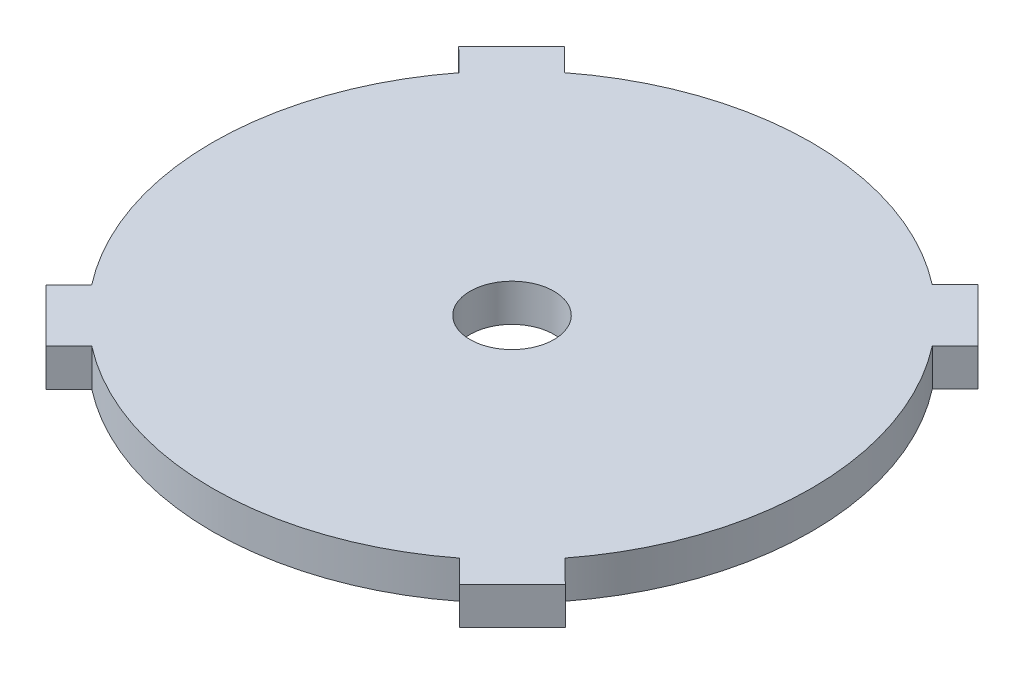
ISO-10303-21;
HEADER;
FILE_DESCRIPTION(('STEP AP214'),'2;1');
FILE_NAME('part.step','',(''),(''),'','','');
FILE_SCHEMA(('AUTOMOTIVE_DESIGN { 1 0 10303 214 1 1 1 1 }'));
ENDSEC;
DATA;
#1=APPLICATION_CONTEXT('core data for automotive mechanical design processes');
#2=APPLICATION_PROTOCOL_DEFINITION('international standard','automotive_design',2000,#1);
#3=PRODUCT_CONTEXT('',#1,'mechanical');
#4=PRODUCT('Part','Part','',(#3));
#5=PRODUCT_RELATED_PRODUCT_CATEGORY('part','',(#4));
#6=PRODUCT_DEFINITION_FORMATION('','',#4);
#7=PRODUCT_DEFINITION_CONTEXT('part definition',#1,'design');
#8=PRODUCT_DEFINITION('design','',#6,#7);
#9=PRODUCT_DEFINITION_SHAPE('','',#8);
#10=(LENGTH_UNIT() NAMED_UNIT(*) SI_UNIT(.MILLI.,.METRE.));
#11=(NAMED_UNIT(*) PLANE_ANGLE_UNIT() SI_UNIT($,.RADIAN.));
#12=(NAMED_UNIT(*) SI_UNIT($,.STERADIAN.) SOLID_ANGLE_UNIT());
#13=UNCERTAINTY_MEASURE_WITH_UNIT(LENGTH_MEASURE(1.E-05),#10,'distance_accuracy_value','');
#14=(GEOMETRIC_REPRESENTATION_CONTEXT(3) GLOBAL_UNCERTAINTY_ASSIGNED_CONTEXT((#13)) GLOBAL_UNIT_ASSIGNED_CONTEXT((#10,
#11,#12)) REPRESENTATION_CONTEXT('',''));
#15=CARTESIAN_POINT('',(0.,0.,0.));
#16=DIRECTION('',(0.,0.,1.));
#17=DIRECTION('',(1.,0.,0.));
#18=AXIS2_PLACEMENT_3D('',#15,#16,#17);
#19=CARTESIAN_POINT('',(0.,3.175,0.));
#20=DIRECTION('',(0.,1.,0.));
#21=DIRECTION('',(0.,0.,1.));
#22=AXIS2_PLACEMENT_3D('',#19,#20,#21);
#23=PLANE('',#22);
#24=CARTESIAN_POINT('',(0.,3.175,0.));
#25=DIRECTION('',(0.,1.,0.));
#26=DIRECTION('',(0.,0.,1.));
#27=AXIS2_PLACEMENT_3D('',#24,#25,#26);
#28=CIRCLE('',#27,25.4);
#29=CARTESIAN_POINT('',(15.5615434417537,3.175,-20.074819194962));
#30=VERTEX_POINT('',#29);
#31=CARTESIAN_POINT('',(-15.5876085360687,3.175,-20.0545870096165));
#32=VERTEX_POINT('',#31);
#33=EDGE_CURVE('E210',#30,#32,#28,.T.);
#34=ORIENTED_EDGE('',*,*,#33,.T.);
#35=DIRECTION('',(-0.70756591619888,0.,-0.706647347857218));
#36=VECTOR('',#35,1.);
#37=CARTESIAN_POINT('',(-15.5876085360687,3.175,-20.0545870096165));
#38=LINE('',#37,#36);
#39=CARTESIAN_POINT('',(-17.52578636915,3.175,-21.9902486830621));
#40=VERTEX_POINT('',#39);
#41=EDGE_CURVE('E118',#32,#40,#38,.T.);
#42=ORIENTED_EDGE('',*,*,#41,.T.);
#43=DIRECTION('',(-0.706647347857217,0.,0.70756591619888));
#44=VECTOR('',#43,1.);
#45=CARTESIAN_POINT('',(-22.0129970280434,3.175,-17.4972051151992));
#46=LINE('',#45,#44);
#47=CARTESIAN_POINT('',(-22.0129970280434,3.175,-17.4972051151992));
#48=VERTEX_POINT('',#47);
#49=EDGE_CURVE('E249',#40,#48,#46,.T.);
#50=ORIENTED_EDGE('',*,*,#49,.T.);
#51=DIRECTION('',(0.707565916198881,0.,0.706647347857217));
#52=VECTOR('',#51,1.);
#53=CARTESIAN_POINT('',(-20.074819194962,3.175,-15.5615434417536));
#54=LINE('',#53,#52);
#55=CARTESIAN_POINT('',(-20.074819194962,3.175,-15.5615434417536));
#56=VERTEX_POINT('',#55);
#57=EDGE_CURVE('E268',#48,#56,#54,.T.);
#58=ORIENTED_EDGE('',*,*,#57,.T.);
#59=CARTESIAN_POINT('',(0.,3.175,0.));
#60=DIRECTION('',(0.,1.,0.));
#61=DIRECTION('',(0.,0.,1.));
#62=AXIS2_PLACEMENT_3D('',#59,#60,#61);
#63=CIRCLE('',#62,25.4);
#64=CARTESIAN_POINT('',(-20.0545870096166,3.175,15.5876085360686));
#65=VERTEX_POINT('',#64);
#66=EDGE_CURVE('E265',#56,#65,#63,.T.);
#67=ORIENTED_EDGE('',*,*,#66,.T.);
#68=DIRECTION('',(-0.70664734785722,0.,0.707565916198878));
#69=VECTOR('',#68,1.);
#70=CARTESIAN_POINT('',(-21.9902486830621,3.175,17.5257863691499));
#71=LINE('',#70,#69);
#72=CARTESIAN_POINT('',(-21.9902486830621,3.175,17.5257863691499));
#73=VERTEX_POINT('',#72);
#74=EDGE_CURVE('E267',#65,#73,#71,.T.);
#75=ORIENTED_EDGE('',*,*,#74,.T.);
#76=DIRECTION('',(0.707565916198878,0.,0.70664734785722));
#77=VECTOR('',#76,1.);
#78=CARTESIAN_POINT('',(-21.9902486830621,3.175,17.5257863691499));
#79=LINE('',#78,#77);
#80=CARTESIAN_POINT('',(-17.4972051151993,3.175,22.0129970280433));
#81=VERTEX_POINT('',#80);
#82=EDGE_CURVE('E270',#73,#81,#79,.T.);
#83=ORIENTED_EDGE('',*,*,#82,.T.);
#84=DIRECTION('',(0.706647347857219,0.,-0.707565916198879));
#85=VECTOR('',#84,1.);
#86=CARTESIAN_POINT('',(-17.4972051151993,3.175,22.0129970280433));
#87=LINE('',#86,#85);
#88=CARTESIAN_POINT('',(-15.5615434417537,3.175,20.074819194962));
#89=VERTEX_POINT('',#88);
#90=EDGE_CURVE('E276',#81,#89,#87,.T.);
#91=ORIENTED_EDGE('',*,*,#90,.T.);
#92=CARTESIAN_POINT('',(0.,3.175,0.));
#93=DIRECTION('',(0.,1.,0.));
#94=DIRECTION('',(0.,0.,1.));
#95=AXIS2_PLACEMENT_3D('',#92,#93,#94);
#96=CIRCLE('',#95,25.4);
#97=CARTESIAN_POINT('',(15.5876085360687,3.175,20.0545870096165));
#98=VERTEX_POINT('',#97);
#99=EDGE_CURVE('E278',#89,#98,#96,.T.);
#100=ORIENTED_EDGE('',*,*,#99,.T.);
#101=DIRECTION('',(0.707565916198882,0.,0.706647347857216));
#102=VECTOR('',#101,1.);
#103=CARTESIAN_POINT('',(17.52578636915,3.175,21.990248683062));
#104=LINE('',#103,#102);
#105=CARTESIAN_POINT('',(17.52578636915,3.175,21.990248683062));
#106=VERTEX_POINT('',#105);
#107=EDGE_CURVE('E280',#98,#106,#104,.T.);
#108=ORIENTED_EDGE('',*,*,#107,.T.);
#109=DIRECTION('',(0.706647347857217,0.,-0.70756591619888));
#110=VECTOR('',#109,1.);
#111=CARTESIAN_POINT('',(17.52578636915,3.175,21.990248683062));
#112=LINE('',#111,#110);
#113=CARTESIAN_POINT('',(22.0129970280433,3.175,17.4972051151992));
#114=VERTEX_POINT('',#113);
#115=EDGE_CURVE('E282',#106,#114,#112,.T.);
#116=ORIENTED_EDGE('',*,*,#115,.T.);
#117=DIRECTION('',(-0.707565916198865,0.,-0.706647347857232));
#118=VECTOR('',#117,1.);
#119=CARTESIAN_POINT('',(22.0129970280433,3.175,17.4972051151992));
#120=LINE('',#119,#118);
#121=CARTESIAN_POINT('',(20.074819194962,3.175,15.5615434417536));
#122=VERTEX_POINT('',#121);
#123=EDGE_CURVE('E284',#114,#122,#120,.T.);
#124=ORIENTED_EDGE('',*,*,#123,.T.);
#125=CARTESIAN_POINT('',(0.,3.175,0.));
#126=DIRECTION('',(0.,1.,0.));
#127=DIRECTION('',(0.,0.,1.));
#128=AXIS2_PLACEMENT_3D('',#125,#126,#127);
#129=CIRCLE('',#128,25.4);
#130=CARTESIAN_POINT('',(20.0545870096165,3.175,-15.5876085360686));
#131=VERTEX_POINT('',#130);
#132=EDGE_CURVE('E161',#122,#131,#129,.T.);
#133=ORIENTED_EDGE('',*,*,#132,.T.);
#134=DIRECTION('',(0.70664734785722,0.,-0.707565916198878));
#135=VECTOR('',#134,1.);
#136=CARTESIAN_POINT('',(20.0545870096165,3.175,-15.5876085360686));
#137=LINE('',#136,#135);
#138=CARTESIAN_POINT('',(21.9902486830621,3.175,-17.52578636915));
#139=VERTEX_POINT('',#138);
#140=EDGE_CURVE('E155',#131,#139,#137,.T.);
#141=ORIENTED_EDGE('',*,*,#140,.T.);
#142=DIRECTION('',(-0.707565916198878,0.,-0.706647347857219));
#143=VECTOR('',#142,1.);
#144=CARTESIAN_POINT('',(17.4972051151992,3.175,-22.0129970280433));
#145=LINE('',#144,#143);
#146=CARTESIAN_POINT('',(17.4972051151992,3.175,-22.0129970280433));
#147=VERTEX_POINT('',#146);
#148=EDGE_CURVE('E159',#139,#147,#145,.T.);
#149=ORIENTED_EDGE('',*,*,#148,.T.);
#150=DIRECTION('',(-0.706647347857219,0.,0.707565916198879));
#151=VECTOR('',#150,1.);
#152=CARTESIAN_POINT('',(15.5615434417537,3.175,-20.074819194962));
#153=LINE('',#152,#151);
#154=EDGE_CURVE('E51',#147,#30,#153,.T.);
#155=ORIENTED_EDGE('',*,*,#154,.T.);
#156=EDGE_LOOP('',(#34,#42,#50,#58,#67,#75,#83,#91,#100,#108,#116,#124,#133,#141,#149,#155));
#157=FACE_BOUND('',#156,.T.);
#158=CARTESIAN_POINT('',(0.,3.175,0.));
#159=DIRECTION('',(0.,1.,0.));
#160=DIRECTION('',(0.,0.,1.));
#161=AXIS2_PLACEMENT_3D('',#158,#159,#160);
#162=CIRCLE('',#161,3.556);
#163=CARTESIAN_POINT('',(0.,3.175,3.556));
#164=VERTEX_POINT('',#163);
#165=EDGE_CURVE('E183',#164,#164,#162,.T.);
#166=ORIENTED_EDGE('',*,*,#165,.F.);
#167=EDGE_LOOP('',(#166));
#168=FACE_BOUND('',#167,.T.);
#169=ADVANCED_FACE('F34',(#157,#168),#23,.T.);
#170=CARTESIAN_POINT('',(0.,0.,0.));
#171=DIRECTION('',(0.,1.,0.));
#172=DIRECTION('',(0.,0.,1.));
#173=AXIS2_PLACEMENT_3D('',#170,#171,#172);
#174=PLANE('',#173);
#175=CARTESIAN_POINT('',(0.,0.,0.));
#176=DIRECTION('',(0.,1.,0.));
#177=DIRECTION('',(0.,0.,1.));
#178=AXIS2_PLACEMENT_3D('',#175,#176,#177);
#179=CIRCLE('',#178,25.4);
#180=CARTESIAN_POINT('',(15.5615434417537,0.,-20.074819194962));
#181=VERTEX_POINT('',#180);
#182=CARTESIAN_POINT('',(-15.5876085360687,0.,-20.0545870096165));
#183=VERTEX_POINT('',#182);
#184=EDGE_CURVE('E179',#181,#183,#179,.T.);
#185=ORIENTED_EDGE('',*,*,#184,.F.);
#186=DIRECTION('',(-0.706647347857219,0.,0.707565916198879));
#187=VECTOR('',#186,1.);
#188=CARTESIAN_POINT('',(15.5615434417537,0.,-20.074819194962));
#189=LINE('',#188,#187);
#190=CARTESIAN_POINT('',(17.4972051151992,0.,-22.0129970280433));
#191=VERTEX_POINT('',#190);
#192=EDGE_CURVE('E110',#191,#181,#189,.T.);
#193=ORIENTED_EDGE('',*,*,#192,.F.);
#194=DIRECTION('',(-0.707565916198878,0.,-0.706647347857219));
#195=VECTOR('',#194,1.);
#196=CARTESIAN_POINT('',(17.4972051151992,0.,-22.0129970280433));
#197=LINE('',#196,#195);
#198=CARTESIAN_POINT('',(21.9902486830621,0.,-17.52578636915));
#199=VERTEX_POINT('',#198);
#200=EDGE_CURVE('E104',#199,#191,#197,.T.);
#201=ORIENTED_EDGE('',*,*,#200,.F.);
#202=DIRECTION('',(0.70664734785722,0.,-0.707565916198878));
#203=VECTOR('',#202,1.);
#204=CARTESIAN_POINT('',(20.0545870096165,0.,-15.5876085360686));
#205=LINE('',#204,#203);
#206=CARTESIAN_POINT('',(20.0545870096165,0.,-15.5876085360686));
#207=VERTEX_POINT('',#206);
#208=EDGE_CURVE('E169',#207,#199,#205,.T.);
#209=ORIENTED_EDGE('',*,*,#208,.F.);
#210=CARTESIAN_POINT('',(0.,0.,0.));
#211=DIRECTION('',(0.,1.,0.));
#212=DIRECTION('',(0.,0.,1.));
#213=AXIS2_PLACEMENT_3D('',#210,#211,#212);
#214=CIRCLE('',#213,25.4);
#215=CARTESIAN_POINT('',(20.074819194962,0.,15.5615434417536));
#216=VERTEX_POINT('',#215);
#217=EDGE_CURVE('E205',#216,#207,#214,.T.);
#218=ORIENTED_EDGE('',*,*,#217,.F.);
#219=DIRECTION('',(-0.707565916198865,0.,-0.706647347857232));
#220=VECTOR('',#219,1.);
#221=CARTESIAN_POINT('',(22.0129970280433,0.,17.4972051151992));
#222=LINE('',#221,#220);
#223=CARTESIAN_POINT('',(22.0129970280433,0.,17.4972051151992));
#224=VERTEX_POINT('',#223);
#225=EDGE_CURVE('E203',#224,#216,#222,.T.);
#226=ORIENTED_EDGE('',*,*,#225,.F.);
#227=DIRECTION('',(0.706647347857217,0.,-0.70756591619888));
#228=VECTOR('',#227,1.);
#229=CARTESIAN_POINT('',(17.52578636915,0.,21.990248683062));
#230=LINE('',#229,#228);
#231=CARTESIAN_POINT('',(17.52578636915,0.,21.990248683062));
#232=VERTEX_POINT('',#231);
#233=EDGE_CURVE('E201',#232,#224,#230,.T.);
#234=ORIENTED_EDGE('',*,*,#233,.F.);
#235=DIRECTION('',(0.707565916198882,0.,0.706647347857216));
#236=VECTOR('',#235,1.);
#237=CARTESIAN_POINT('',(17.52578636915,0.,21.990248683062));
#238=LINE('',#237,#236);
#239=CARTESIAN_POINT('',(15.5876085360687,0.,20.0545870096165));
#240=VERTEX_POINT('',#239);
#241=EDGE_CURVE('E199',#240,#232,#238,.T.);
#242=ORIENTED_EDGE('',*,*,#241,.F.);
#243=CARTESIAN_POINT('',(0.,0.,0.));
#244=DIRECTION('',(0.,1.,0.));
#245=DIRECTION('',(0.,0.,1.));
#246=AXIS2_PLACEMENT_3D('',#243,#244,#245);
#247=CIRCLE('',#246,25.4);
#248=CARTESIAN_POINT('',(-15.5615434417537,0.,20.074819194962));
#249=VERTEX_POINT('',#248);
#250=EDGE_CURVE('E197',#249,#240,#247,.T.);
#251=ORIENTED_EDGE('',*,*,#250,.F.);
#252=DIRECTION('',(0.706647347857219,0.,-0.707565916198879));
#253=VECTOR('',#252,1.);
#254=CARTESIAN_POINT('',(-17.4972051151993,0.,22.0129970280433));
#255=LINE('',#254,#253);
#256=CARTESIAN_POINT('',(-17.4972051151993,0.,22.0129970280433));
#257=VERTEX_POINT('',#256);
#258=EDGE_CURVE('E195',#257,#249,#255,.T.);
#259=ORIENTED_EDGE('',*,*,#258,.F.);
#260=DIRECTION('',(0.707565916198878,0.,0.70664734785722));
#261=VECTOR('',#260,1.);
#262=CARTESIAN_POINT('',(-21.9902486830621,0.,17.5257863691499));
#263=LINE('',#262,#261);
#264=CARTESIAN_POINT('',(-21.9902486830621,0.,17.5257863691499));
#265=VERTEX_POINT('',#264);
#266=EDGE_CURVE('E193',#265,#257,#263,.T.);
#267=ORIENTED_EDGE('',*,*,#266,.F.);
#268=DIRECTION('',(-0.70664734785722,0.,0.707565916198878));
#269=VECTOR('',#268,1.);
#270=CARTESIAN_POINT('',(-21.9902486830621,0.,17.5257863691499));
#271=LINE('',#270,#269);
#272=CARTESIAN_POINT('',(-20.0545870096166,0.,15.5876085360686));
#273=VERTEX_POINT('',#272);
#274=EDGE_CURVE('E191',#273,#265,#271,.T.);
#275=ORIENTED_EDGE('',*,*,#274,.F.);
#276=CARTESIAN_POINT('',(0.,0.,0.));
#277=DIRECTION('',(0.,1.,0.));
#278=DIRECTION('',(0.,0.,1.));
#279=AXIS2_PLACEMENT_3D('',#276,#277,#278);
#280=CIRCLE('',#279,25.4);
#281=CARTESIAN_POINT('',(-20.074819194962,0.,-15.5615434417536));
#282=VERTEX_POINT('',#281);
#283=EDGE_CURVE('E189',#282,#273,#280,.T.);
#284=ORIENTED_EDGE('',*,*,#283,.F.);
#285=DIRECTION('',(0.707565916198881,0.,0.706647347857217));
#286=VECTOR('',#285,1.);
#287=CARTESIAN_POINT('',(-20.074819194962,0.,-15.5615434417536));
#288=LINE('',#287,#286);
#289=CARTESIAN_POINT('',(-22.0129970280434,0.,-17.4972051151992));
#290=VERTEX_POINT('',#289);
#291=EDGE_CURVE('E187',#290,#282,#288,.T.);
#292=ORIENTED_EDGE('',*,*,#291,.F.);
#293=DIRECTION('',(-0.706647347857217,0.,0.70756591619888));
#294=VECTOR('',#293,1.);
#295=CARTESIAN_POINT('',(-22.0129970280434,0.,-17.4972051151992));
#296=LINE('',#295,#294);
#297=CARTESIAN_POINT('',(-17.52578636915,0.,-21.9902486830621));
#298=VERTEX_POINT('',#297);
#299=EDGE_CURVE('E185',#298,#290,#296,.T.);
#300=ORIENTED_EDGE('',*,*,#299,.F.);
#301=DIRECTION('',(-0.70756591619888,0.,-0.706647347857218));
#302=VECTOR('',#301,1.);
#303=CARTESIAN_POINT('',(-15.5876085360687,0.,-20.0545870096165));
#304=LINE('',#303,#302);
#305=EDGE_CURVE('E182',#183,#298,#304,.T.);
#306=ORIENTED_EDGE('',*,*,#305,.F.);
#307=EDGE_LOOP('',(#185,#193,#201,#209,#218,#226,#234,#242,#251,#259,#267,#275,#284,#292,#300,#306));
#308=FACE_BOUND('',#307,.T.);
#309=CARTESIAN_POINT('',(0.,0.,0.));
#310=DIRECTION('',(0.,1.,0.));
#311=DIRECTION('',(0.,0.,1.));
#312=AXIS2_PLACEMENT_3D('',#309,#310,#311);
#313=CIRCLE('',#312,3.556);
#314=CARTESIAN_POINT('',(0.,0.,3.556));
#315=VERTEX_POINT('',#314);
#316=EDGE_CURVE('E483',#315,#315,#313,.T.);
#317=ORIENTED_EDGE('',*,*,#316,.T.);
#318=EDGE_LOOP('',(#317));
#319=FACE_BOUND('',#318,.T.);
#320=ADVANCED_FACE('F253',(#308,#319),#174,.F.);
#321=CARTESIAN_POINT('',(0.,3.175,0.));
#322=DIRECTION('',(0.,-1.,0.));
#323=DIRECTION('',(0.,0.,-1.));
#324=AXIS2_PLACEMENT_3D('',#321,#322,#323);
#325=CYLINDRICAL_SURFACE('',#324,25.4);
#326=ORIENTED_EDGE('',*,*,#184,.T.);
#327=DIRECTION('',(0.,-1.,0.));
#328=VECTOR('',#327,1.);
#329=CARTESIAN_POINT('',(-15.5876085360687,3.175,-20.0545870096165));
#330=LINE('',#329,#328);
#331=EDGE_CURVE('E11',#32,#183,#330,.T.);
#332=ORIENTED_EDGE('',*,*,#331,.F.);
#333=ORIENTED_EDGE('',*,*,#33,.F.);
#334=DIRECTION('',(0.,-1.,0.));
#335=VECTOR('',#334,1.);
#336=CARTESIAN_POINT('',(15.5615434417537,3.175,-20.074819194962));
#337=LINE('',#336,#335);
#338=EDGE_CURVE('E175',#30,#181,#337,.T.);
#339=ORIENTED_EDGE('',*,*,#338,.T.);
#340=EDGE_LOOP('',(#326,#332,#333,#339));
#341=FACE_BOUND('',#340,.T.);
#342=ADVANCED_FACE('F36',(#341),#325,.T.);
#343=CARTESIAN_POINT('',(-15.5876085360687,3.175,-20.0545870096165));
#344=DIRECTION('',(-0.706647347857218,0.,0.70756591619888));
#345=DIRECTION('',(0.70756591619888,0.,0.706647347857218));
#346=AXIS2_PLACEMENT_3D('',#343,#344,#345);
#347=PLANE('',#346);
#348=ORIENTED_EDGE('',*,*,#305,.T.);
#349=DIRECTION('',(0.,-1.,0.));
#350=VECTOR('',#349,1.);
#351=CARTESIAN_POINT('',(-17.52578636915,3.175,-21.9902486830621));
#352=LINE('',#351,#350);
#353=EDGE_CURVE('E43',#40,#298,#352,.T.);
#354=ORIENTED_EDGE('',*,*,#353,.F.);
#355=ORIENTED_EDGE('',*,*,#41,.F.);
#356=ORIENTED_EDGE('',*,*,#331,.T.);
#357=EDGE_LOOP('',(#348,#354,#355,#356));
#358=FACE_BOUND('',#357,.T.);
#359=ADVANCED_FACE('F318',(#358),#347,.F.);
#360=CARTESIAN_POINT('',(-22.0129970280434,3.175,-17.4972051151992));
#361=DIRECTION('',(0.70756591619888,0.,0.706647347857217));
#362=DIRECTION('',(0.706647347857217,0.,-0.70756591619888));
#363=AXIS2_PLACEMENT_3D('',#360,#361,#362);
#364=PLANE('',#363);
#365=ORIENTED_EDGE('',*,*,#299,.T.);
#366=DIRECTION('',(0.,-1.,0.));
#367=VECTOR('',#366,1.);
#368=CARTESIAN_POINT('',(-22.0129970280434,3.175,-17.4972051151992));
#369=LINE('',#368,#367);
#370=EDGE_CURVE('E241',#48,#290,#369,.T.);
#371=ORIENTED_EDGE('',*,*,#370,.F.);
#372=ORIENTED_EDGE('',*,*,#49,.F.);
#373=ORIENTED_EDGE('',*,*,#353,.T.);
#374=EDGE_LOOP('',(#365,#371,#372,#373));
#375=FACE_BOUND('',#374,.T.);
#376=ADVANCED_FACE('F247',(#375),#364,.F.);
#377=CARTESIAN_POINT('',(-20.074819194962,3.175,-15.5615434417536));
#378=DIRECTION('',(0.706647347857217,0.,-0.707565916198881));
#379=DIRECTION('',(-0.707565916198881,0.,-0.706647347857217));
#380=AXIS2_PLACEMENT_3D('',#377,#378,#379);
#381=PLANE('',#380);
#382=ORIENTED_EDGE('',*,*,#291,.T.);
#383=DIRECTION('',(0.,-1.,0.));
#384=VECTOR('',#383,1.);
#385=CARTESIAN_POINT('',(-20.074819194962,3.175,-15.5615434417536));
#386=LINE('',#385,#384);
#387=EDGE_CURVE('E238',#56,#282,#386,.T.);
#388=ORIENTED_EDGE('',*,*,#387,.F.);
#389=ORIENTED_EDGE('',*,*,#57,.F.);
#390=ORIENTED_EDGE('',*,*,#370,.T.);
#391=EDGE_LOOP('',(#382,#388,#389,#390));
#392=FACE_BOUND('',#391,.T.);
#393=ADVANCED_FACE('F259',(#392),#381,.F.);
#394=CARTESIAN_POINT('',(0.,3.175,0.));
#395=DIRECTION('',(0.,-1.,0.));
#396=DIRECTION('',(0.,0.,-1.));
#397=AXIS2_PLACEMENT_3D('',#394,#395,#396);
#398=CYLINDRICAL_SURFACE('',#397,25.4);
#399=ORIENTED_EDGE('',*,*,#283,.T.);
#400=DIRECTION('',(0.,-1.,0.));
#401=VECTOR('',#400,1.);
#402=CARTESIAN_POINT('',(-20.0545870096166,3.175,15.5876085360686));
#403=LINE('',#402,#401);
#404=EDGE_CURVE('E235',#65,#273,#403,.T.);
#405=ORIENTED_EDGE('',*,*,#404,.F.);
#406=ORIENTED_EDGE('',*,*,#66,.F.);
#407=ORIENTED_EDGE('',*,*,#387,.T.);
#408=EDGE_LOOP('',(#399,#405,#406,#407));
#409=FACE_BOUND('',#408,.T.);
#410=ADVANCED_FACE('F263',(#409),#398,.T.);
#411=CARTESIAN_POINT('',(-21.9902486830621,3.175,17.5257863691499));
#412=DIRECTION('',(0.707565916198878,0.,0.70664734785722));
#413=DIRECTION('',(0.70664734785722,0.,-0.707565916198878));
#414=AXIS2_PLACEMENT_3D('',#411,#412,#413);
#415=PLANE('',#414);
#416=ORIENTED_EDGE('',*,*,#274,.T.);
#417=DIRECTION('',(0.,-1.,0.));
#418=VECTOR('',#417,1.);
#419=CARTESIAN_POINT('',(-21.9902486830621,3.175,17.5257863691499));
#420=LINE('',#419,#418);
#421=EDGE_CURVE('E232',#73,#265,#420,.T.);
#422=ORIENTED_EDGE('',*,*,#421,.F.);
#423=ORIENTED_EDGE('',*,*,#74,.F.);
#424=ORIENTED_EDGE('',*,*,#404,.T.);
#425=EDGE_LOOP('',(#416,#422,#423,#424));
#426=FACE_BOUND('',#425,.T.);
#427=ADVANCED_FACE('F331',(#426),#415,.F.);
#428=CARTESIAN_POINT('',(-21.9902486830621,3.175,17.5257863691499));
#429=DIRECTION('',(0.70664734785722,0.,-0.707565916198878));
#430=DIRECTION('',(-0.707565916198878,0.,-0.70664734785722));
#431=AXIS2_PLACEMENT_3D('',#428,#429,#430);
#432=PLANE('',#431);
#433=ORIENTED_EDGE('',*,*,#266,.T.);
#434=DIRECTION('',(0.,-1.,0.));
#435=VECTOR('',#434,1.);
#436=CARTESIAN_POINT('',(-17.4972051151993,3.175,22.0129970280433));
#437=LINE('',#436,#435);
#438=EDGE_CURVE('E229',#81,#257,#437,.T.);
#439=ORIENTED_EDGE('',*,*,#438,.F.);
#440=ORIENTED_EDGE('',*,*,#82,.F.);
#441=ORIENTED_EDGE('',*,*,#421,.T.);
#442=EDGE_LOOP('',(#433,#439,#440,#441));
#443=FACE_BOUND('',#442,.T.);
#444=ADVANCED_FACE('F334',(#443),#432,.F.);
#445=CARTESIAN_POINT('',(-17.4972051151993,3.175,22.0129970280433));
#446=DIRECTION('',(-0.707565916198879,0.,-0.706647347857219));
#447=DIRECTION('',(-0.706647347857219,0.,0.707565916198879));
#448=AXIS2_PLACEMENT_3D('',#445,#446,#447);
#449=PLANE('',#448);
#450=ORIENTED_EDGE('',*,*,#258,.T.);
#451=DIRECTION('',(0.,-1.,0.));
#452=VECTOR('',#451,1.);
#453=CARTESIAN_POINT('',(-15.5615434417537,3.175,20.074819194962));
#454=LINE('',#453,#452);
#455=EDGE_CURVE('E226',#89,#249,#454,.T.);
#456=ORIENTED_EDGE('',*,*,#455,.F.);
#457=ORIENTED_EDGE('',*,*,#90,.F.);
#458=ORIENTED_EDGE('',*,*,#438,.T.);
#459=EDGE_LOOP('',(#450,#456,#457,#458));
#460=FACE_BOUND('',#459,.T.);
#461=ADVANCED_FACE('F338',(#460),#449,.F.);
#462=CARTESIAN_POINT('',(0.,3.175,0.));
#463=DIRECTION('',(0.,-1.,0.));
#464=DIRECTION('',(0.,0.,-1.));
#465=AXIS2_PLACEMENT_3D('',#462,#463,#464);
#466=CYLINDRICAL_SURFACE('',#465,25.4);
#467=ORIENTED_EDGE('',*,*,#250,.T.);
#468=DIRECTION('',(0.,-1.,0.));
#469=VECTOR('',#468,1.);
#470=CARTESIAN_POINT('',(15.5876085360687,3.175,20.0545870096165));
#471=LINE('',#470,#469);
#472=EDGE_CURVE('E223',#98,#240,#471,.T.);
#473=ORIENTED_EDGE('',*,*,#472,.F.);
#474=ORIENTED_EDGE('',*,*,#99,.F.);
#475=ORIENTED_EDGE('',*,*,#455,.T.);
#476=EDGE_LOOP('',(#467,#473,#474,#475));
#477=FACE_BOUND('',#476,.T.);
#478=ADVANCED_FACE('F342',(#477),#466,.T.);
#479=CARTESIAN_POINT('',(17.52578636915,3.175,21.990248683062));
#480=DIRECTION('',(0.706647347857216,0.,-0.707565916198882));
#481=DIRECTION('',(-0.707565916198882,0.,-0.706647347857216));
#482=AXIS2_PLACEMENT_3D('',#479,#480,#481);
#483=PLANE('',#482);
#484=ORIENTED_EDGE('',*,*,#241,.T.);
#485=DIRECTION('',(0.,-1.,0.));
#486=VECTOR('',#485,1.);
#487=CARTESIAN_POINT('',(17.52578636915,3.175,21.990248683062));
#488=LINE('',#487,#486);
#489=EDGE_CURVE('E220',#106,#232,#488,.T.);
#490=ORIENTED_EDGE('',*,*,#489,.F.);
#491=ORIENTED_EDGE('',*,*,#107,.F.);
#492=ORIENTED_EDGE('',*,*,#472,.T.);
#493=EDGE_LOOP('',(#484,#490,#491,#492));
#494=FACE_BOUND('',#493,.T.);
#495=ADVANCED_FACE('F346',(#494),#483,.F.);
#496=CARTESIAN_POINT('',(17.52578636915,3.175,21.990248683062));
#497=DIRECTION('',(-0.70756591619888,0.,-0.706647347857217));
#498=DIRECTION('',(-0.706647347857217,0.,0.70756591619888));
#499=AXIS2_PLACEMENT_3D('',#496,#497,#498);
#500=PLANE('',#499);
#501=ORIENTED_EDGE('',*,*,#233,.T.);
#502=DIRECTION('',(0.,-1.,0.));
#503=VECTOR('',#502,1.);
#504=CARTESIAN_POINT('',(22.0129970280433,3.175,17.4972051151992));
#505=LINE('',#504,#503);
#506=EDGE_CURVE('E217',#114,#224,#505,.T.);
#507=ORIENTED_EDGE('',*,*,#506,.F.);
#508=ORIENTED_EDGE('',*,*,#115,.F.);
#509=ORIENTED_EDGE('',*,*,#489,.T.);
#510=EDGE_LOOP('',(#501,#507,#508,#509));
#511=FACE_BOUND('',#510,.T.);
#512=ADVANCED_FACE('F350',(#511),#500,.F.);
#513=CARTESIAN_POINT('',(22.0129970280433,3.175,17.4972051151992));
#514=DIRECTION('',(-0.706647347857232,0.,0.707565916198865));
#515=DIRECTION('',(0.707565916198865,0.,0.706647347857232));
#516=AXIS2_PLACEMENT_3D('',#513,#514,#515);
#517=PLANE('',#516);
#518=ORIENTED_EDGE('',*,*,#225,.T.);
#519=DIRECTION('',(0.,-1.,0.));
#520=VECTOR('',#519,1.);
#521=CARTESIAN_POINT('',(20.074819194962,3.175,15.5615434417536));
#522=LINE('',#521,#520);
#523=EDGE_CURVE('E214',#122,#216,#522,.T.);
#524=ORIENTED_EDGE('',*,*,#523,.F.);
#525=ORIENTED_EDGE('',*,*,#123,.F.);
#526=ORIENTED_EDGE('',*,*,#506,.T.);
#527=EDGE_LOOP('',(#518,#524,#525,#526));
#528=FACE_BOUND('',#527,.T.);
#529=ADVANCED_FACE('F290',(#528),#517,.F.);
#530=CARTESIAN_POINT('',(0.,3.175,0.));
#531=DIRECTION('',(0.,-1.,0.));
#532=DIRECTION('',(0.,0.,-1.));
#533=AXIS2_PLACEMENT_3D('',#530,#531,#532);
#534=CYLINDRICAL_SURFACE('',#533,25.4);
#535=ORIENTED_EDGE('',*,*,#217,.T.);
#536=DIRECTION('',(0.,-1.,0.));
#537=VECTOR('',#536,1.);
#538=CARTESIAN_POINT('',(20.0545870096165,3.175,-15.5876085360686));
#539=LINE('',#538,#537);
#540=EDGE_CURVE('E170',#131,#207,#539,.T.);
#541=ORIENTED_EDGE('',*,*,#540,.F.);
#542=ORIENTED_EDGE('',*,*,#132,.F.);
#543=ORIENTED_EDGE('',*,*,#523,.T.);
#544=EDGE_LOOP('',(#535,#541,#542,#543));
#545=FACE_BOUND('',#544,.T.);
#546=ADVANCED_FACE('F294',(#545),#534,.T.);
#547=CARTESIAN_POINT('',(20.0545870096165,3.175,-15.5876085360686));
#548=DIRECTION('',(-0.707565916198878,0.,-0.70664734785722));
#549=DIRECTION('',(-0.70664734785722,0.,0.707565916198878));
#550=AXIS2_PLACEMENT_3D('',#547,#548,#549);
#551=PLANE('',#550);
#552=ORIENTED_EDGE('',*,*,#208,.T.);
#553=DIRECTION('',(0.,-1.,0.));
#554=VECTOR('',#553,1.);
#555=CARTESIAN_POINT('',(21.9902486830621,3.175,-17.52578636915));
#556=LINE('',#555,#554);
#557=EDGE_CURVE('E166',#139,#199,#556,.T.);
#558=ORIENTED_EDGE('',*,*,#557,.F.);
#559=ORIENTED_EDGE('',*,*,#140,.F.);
#560=ORIENTED_EDGE('',*,*,#540,.T.);
#561=EDGE_LOOP('',(#552,#558,#559,#560));
#562=FACE_BOUND('',#561,.T.);
#563=ADVANCED_FACE('F167',(#562),#551,.F.);
#564=CARTESIAN_POINT('',(17.4972051151992,3.175,-22.0129970280433));
#565=DIRECTION('',(-0.706647347857219,0.,0.707565916198878));
#566=DIRECTION('',(0.707565916198878,0.,0.706647347857219));
#567=AXIS2_PLACEMENT_3D('',#564,#565,#566);
#568=PLANE('',#567);
#569=ORIENTED_EDGE('',*,*,#200,.T.);
#570=DIRECTION('',(0.,-1.,0.));
#571=VECTOR('',#570,1.);
#572=CARTESIAN_POINT('',(17.4972051151992,3.175,-22.0129970280433));
#573=LINE('',#572,#571);
#574=EDGE_CURVE('E171',#147,#191,#573,.T.);
#575=ORIENTED_EDGE('',*,*,#574,.F.);
#576=ORIENTED_EDGE('',*,*,#148,.F.);
#577=ORIENTED_EDGE('',*,*,#557,.T.);
#578=EDGE_LOOP('',(#569,#575,#576,#577));
#579=FACE_BOUND('',#578,.T.);
#580=ADVANCED_FACE('F173',(#579),#568,.F.);
#581=CARTESIAN_POINT('',(15.5615434417537,3.175,-20.074819194962));
#582=DIRECTION('',(0.707565916198878,0.,0.706647347857219));
#583=DIRECTION('',(0.706647347857219,0.,-0.707565916198879));
#584=AXIS2_PLACEMENT_3D('',#581,#582,#583);
#585=PLANE('',#584);
#586=ORIENTED_EDGE('',*,*,#192,.T.);
#587=ORIENTED_EDGE('',*,*,#338,.F.);
#588=ORIENTED_EDGE('',*,*,#154,.F.);
#589=ORIENTED_EDGE('',*,*,#574,.T.);
#590=EDGE_LOOP('',(#586,#587,#588,#589));
#591=FACE_BOUND('',#590,.T.);
#592=ADVANCED_FACE('F298',(#591),#585,.F.);
#593=CARTESIAN_POINT('',(0.,3.175,0.));
#594=DIRECTION('',(0.,-1.,0.));
#595=DIRECTION('',(0.,0.,-1.));
#596=AXIS2_PLACEMENT_3D('',#593,#594,#595);
#597=CYLINDRICAL_SURFACE('',#596,3.556);
#598=ORIENTED_EDGE('',*,*,#165,.T.);
#599=EDGE_LOOP('',(#598));
#600=FACE_BOUND('',#599,.T.);
#601=ORIENTED_EDGE('',*,*,#316,.F.);
#602=EDGE_LOOP('',(#601));
#603=FACE_BOUND('',#602,.T.);
#604=ADVANCED_FACE('F300',(#600,#603),#597,.F.);
#605=CLOSED_SHELL('',(#169,#320,#342,#359,#376,#393,#410,#427,#444,#461,#478,#495,#512,#529,
#546,#563,#580,#592,#604));
#606=MANIFOLD_SOLID_BREP('B2',#605);
#607=ADVANCED_BREP_SHAPE_REPRESENTATION('',(#18,#606),#14);
#608=SHAPE_DEFINITION_REPRESENTATION(#9,#607);
ENDSEC;
END-ISO-10303-21;
